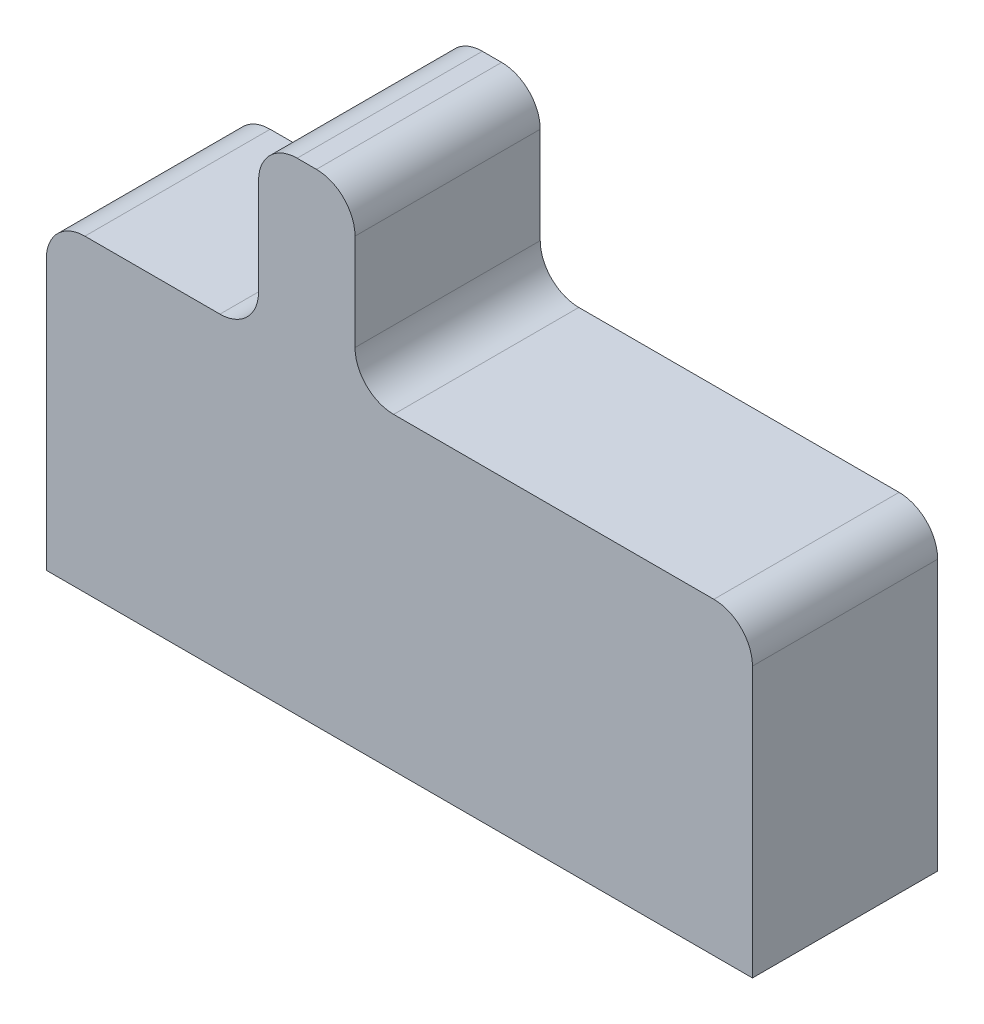
ISO-10303-21;
HEADER;
FILE_DESCRIPTION(('STEP AP214'),'2;1');
FILE_NAME('part.step','',(''),(''),'','','');
FILE_SCHEMA(('AUTOMOTIVE_DESIGN { 1 0 10303 214 1 1 1 1 }'));
ENDSEC;
DATA;
#1=APPLICATION_CONTEXT('core data for automotive mechanical design processes');
#2=APPLICATION_PROTOCOL_DEFINITION('international standard','automotive_design',2000,#1);
#3=PRODUCT_CONTEXT('',#1,'mechanical');
#4=PRODUCT('Part','Part','',(#3));
#5=PRODUCT_RELATED_PRODUCT_CATEGORY('part','',(#4));
#6=PRODUCT_DEFINITION_FORMATION('','',#4);
#7=PRODUCT_DEFINITION_CONTEXT('part definition',#1,'design');
#8=PRODUCT_DEFINITION('design','',#6,#7);
#9=PRODUCT_DEFINITION_SHAPE('','',#8);
#10=(LENGTH_UNIT() NAMED_UNIT(*) SI_UNIT(.MILLI.,.METRE.));
#11=(NAMED_UNIT(*) PLANE_ANGLE_UNIT() SI_UNIT($,.RADIAN.));
#12=(NAMED_UNIT(*) SI_UNIT($,.STERADIAN.) SOLID_ANGLE_UNIT());
#13=UNCERTAINTY_MEASURE_WITH_UNIT(LENGTH_MEASURE(1.E-05),#10,'distance_accuracy_value','');
#14=(GEOMETRIC_REPRESENTATION_CONTEXT(3) GLOBAL_UNCERTAINTY_ASSIGNED_CONTEXT((#13)) GLOBAL_UNIT_ASSIGNED_CONTEXT((#10,
#11,#12)) REPRESENTATION_CONTEXT('',''));
#15=CARTESIAN_POINT('',(0.,0.,0.));
#16=DIRECTION('',(0.,0.,1.));
#17=DIRECTION('',(1.,0.,0.));
#18=AXIS2_PLACEMENT_3D('',#15,#16,#17);
#19=CARTESIAN_POINT('',(1.83,0.8,0.96));
#20=DIRECTION('',(-1.,0.,0.));
#21=DIRECTION('',(0.,-1.,0.));
#22=AXIS2_PLACEMENT_3D('',#19,#20,#21);
#23=PLANE('',#22);
#24=DIRECTION('',(0.,1.,0.));
#25=VECTOR('',#24,1.);
#26=CARTESIAN_POINT('',(1.83,0.8,0.));
#27=LINE('',#26,#25);
#28=CARTESIAN_POINT('',(1.83,-0.8,0.));
#29=VERTEX_POINT('',#28);
#30=CARTESIAN_POINT('',(1.83,0.6,0.));
#31=VERTEX_POINT('',#30);
#32=EDGE_CURVE('E161',#29,#31,#27,.T.);
#33=ORIENTED_EDGE('',*,*,#32,.T.);
#34=DIRECTION('',(0.,0.,-1.));
#35=VECTOR('',#34,1.);
#36=CARTESIAN_POINT('',(1.83,0.6,0.96));
#37=LINE('',#36,#35);
#38=CARTESIAN_POINT('',(1.83,0.6,0.96));
#39=VERTEX_POINT('',#38);
#40=EDGE_CURVE('E216',#31,#39,#37,.F.);
#41=ORIENTED_EDGE('',*,*,#40,.T.);
#42=DIRECTION('',(0.,1.,0.));
#43=VECTOR('',#42,1.);
#44=CARTESIAN_POINT('',(1.83,0.8,0.96));
#45=LINE('',#44,#43);
#46=CARTESIAN_POINT('',(1.83,-0.8,0.96));
#47=VERTEX_POINT('',#46);
#48=EDGE_CURVE('E180',#47,#39,#45,.T.);
#49=ORIENTED_EDGE('',*,*,#48,.F.);
#50=DIRECTION('',(0.,0.,-1.));
#51=VECTOR('',#50,1.);
#52=CARTESIAN_POINT('',(1.83,-0.8,0.96));
#53=LINE('',#52,#51);
#54=EDGE_CURVE('E152',#47,#29,#53,.T.);
#55=ORIENTED_EDGE('',*,*,#54,.T.);
#56=EDGE_LOOP('',(#33,#41,#49,#55));
#57=FACE_BOUND('',#56,.T.);
#58=ADVANCED_FACE('F32',(#57),#23,.F.);
#59=CARTESIAN_POINT('',(-0.23,0.8,0.96));
#60=DIRECTION('',(0.,-1.,0.));
#61=DIRECTION('',(1.,0.,0.));
#62=AXIS2_PLACEMENT_3D('',#59,#60,#61);
#63=PLANE('',#62);
#64=DIRECTION('',(-1.,0.,0.));
#65=VECTOR('',#64,1.);
#66=CARTESIAN_POINT('',(-0.23,0.8,0.96));
#67=LINE('',#66,#65);
#68=CARTESIAN_POINT('',(1.63,0.8,0.96));
#69=VERTEX_POINT('',#68);
#70=CARTESIAN_POINT('',(-0.0299999999999998,0.8,0.96));
#71=VERTEX_POINT('',#70);
#72=EDGE_CURVE('E244',#69,#71,#67,.T.);
#73=ORIENTED_EDGE('',*,*,#72,.F.);
#74=DIRECTION('',(0.,0.,-1.));
#75=VECTOR('',#74,1.);
#76=CARTESIAN_POINT('',(1.63,0.8,0.96));
#77=LINE('',#76,#75);
#78=CARTESIAN_POINT('',(1.63,0.8,0.));
#79=VERTEX_POINT('',#78);
#80=EDGE_CURVE('E213',#69,#79,#77,.T.);
#81=ORIENTED_EDGE('',*,*,#80,.T.);
#82=DIRECTION('',(-1.,0.,0.));
#83=VECTOR('',#82,1.);
#84=CARTESIAN_POINT('',(-0.23,0.8,0.));
#85=LINE('',#84,#83);
#86=CARTESIAN_POINT('',(-0.0299999999999998,0.8,0.));
#87=VERTEX_POINT('',#86);
#88=EDGE_CURVE('E164',#79,#87,#85,.T.);
#89=ORIENTED_EDGE('',*,*,#88,.T.);
#90=DIRECTION('',(0.,0.,-1.));
#91=VECTOR('',#90,1.);
#92=CARTESIAN_POINT('',(-0.0299999999999998,0.8,0.96));
#93=LINE('',#92,#91);
#94=EDGE_CURVE('E211',#87,#71,#93,.F.);
#95=ORIENTED_EDGE('',*,*,#94,.T.);
#96=EDGE_LOOP('',(#73,#81,#89,#95));
#97=FACE_BOUND('',#96,.T.);
#98=ADVANCED_FACE('F237',(#97),#63,.F.);
#99=CARTESIAN_POINT('',(-0.23,1.7,0.96));
#100=DIRECTION('',(-1.,0.,0.));
#101=DIRECTION('',(0.,-1.,0.));
#102=AXIS2_PLACEMENT_3D('',#99,#100,#101);
#103=PLANE('',#102);
#104=DIRECTION('',(0.,1.,0.));
#105=VECTOR('',#104,1.);
#106=CARTESIAN_POINT('',(-0.23,1.7,0.));
#107=LINE('',#106,#105);
#108=CARTESIAN_POINT('',(-0.23,1.,0.));
#109=VERTEX_POINT('',#108);
#110=CARTESIAN_POINT('',(-0.23,1.5,0.));
#111=VERTEX_POINT('',#110);
#112=EDGE_CURVE('E167',#109,#111,#107,.T.);
#113=ORIENTED_EDGE('',*,*,#112,.T.);
#114=DIRECTION('',(0.,0.,-1.));
#115=VECTOR('',#114,1.);
#116=CARTESIAN_POINT('',(-0.23,1.5,0.96));
#117=LINE('',#116,#115);
#118=CARTESIAN_POINT('',(-0.23,1.5,0.96));
#119=VERTEX_POINT('',#118);
#120=EDGE_CURVE('E197',#111,#119,#117,.F.);
#121=ORIENTED_EDGE('',*,*,#120,.T.);
#122=DIRECTION('',(0.,1.,0.));
#123=VECTOR('',#122,1.);
#124=CARTESIAN_POINT('',(-0.23,1.7,0.96));
#125=LINE('',#124,#123);
#126=CARTESIAN_POINT('',(-0.23,1.,0.96));
#127=VERTEX_POINT('',#126);
#128=EDGE_CURVE('E242',#127,#119,#125,.T.);
#129=ORIENTED_EDGE('',*,*,#128,.F.);
#130=DIRECTION('',(0.,0.,-1.));
#131=VECTOR('',#130,1.);
#132=CARTESIAN_POINT('',(-0.23,1.,0.));
#133=LINE('',#132,#131);
#134=EDGE_CURVE('E194',#127,#109,#133,.T.);
#135=ORIENTED_EDGE('',*,*,#134,.T.);
#136=EDGE_LOOP('',(#113,#121,#129,#135));
#137=FACE_BOUND('',#136,.T.);
#138=ADVANCED_FACE('F246',(#137),#103,.F.);
#139=CARTESIAN_POINT('',(-0.73,1.7,0.96));
#140=DIRECTION('',(0.,-1.,0.));
#141=DIRECTION('',(0.,0.,-1.));
#142=AXIS2_PLACEMENT_3D('',#139,#140,#141);
#143=PLANE('',#142);
#144=DIRECTION('',(-1.,0.,0.));
#145=VECTOR('',#144,1.);
#146=CARTESIAN_POINT('',(-0.73,1.7,0.96));
#147=LINE('',#146,#145);
#148=CARTESIAN_POINT('',(-0.43,1.7,0.96));
#149=VERTEX_POINT('',#148);
#150=CARTESIAN_POINT('',(-0.53,1.7,0.96));
#151=VERTEX_POINT('',#150);
#152=EDGE_CURVE('E248',#149,#151,#147,.T.);
#153=ORIENTED_EDGE('',*,*,#152,.F.);
#154=DIRECTION('',(0.,0.,-1.));
#155=VECTOR('',#154,1.);
#156=CARTESIAN_POINT('',(-0.43,1.7,0.96));
#157=LINE('',#156,#155);
#158=CARTESIAN_POINT('',(-0.43,1.7,0.));
#159=VERTEX_POINT('',#158);
#160=EDGE_CURVE('E183',#149,#159,#157,.T.);
#161=ORIENTED_EDGE('',*,*,#160,.T.);
#162=DIRECTION('',(-1.,0.,0.));
#163=VECTOR('',#162,1.);
#164=CARTESIAN_POINT('',(-0.73,1.7,0.));
#165=LINE('',#164,#163);
#166=CARTESIAN_POINT('',(-0.53,1.7,0.));
#167=VERTEX_POINT('',#166);
#168=EDGE_CURVE('E170',#159,#167,#165,.T.);
#169=ORIENTED_EDGE('',*,*,#168,.T.);
#170=DIRECTION('',(0.,0.,-1.));
#171=VECTOR('',#170,1.);
#172=CARTESIAN_POINT('',(-0.53,1.7,0.96));
#173=LINE('',#172,#171);
#174=EDGE_CURVE('E151',#167,#151,#173,.F.);
#175=ORIENTED_EDGE('',*,*,#174,.T.);
#176=EDGE_LOOP('',(#153,#161,#169,#175));
#177=FACE_BOUND('',#176,.T.);
#178=ADVANCED_FACE('F298',(#177),#143,.F.);
#179=CARTESIAN_POINT('',(-0.73,0.8,0.96));
#180=DIRECTION('',(1.,0.,0.));
#181=DIRECTION('',(0.,0.,-1.));
#182=AXIS2_PLACEMENT_3D('',#179,#180,#181);
#183=PLANE('',#182);
#184=DIRECTION('',(0.,-1.,0.));
#185=VECTOR('',#184,1.);
#186=CARTESIAN_POINT('',(-0.73,0.8,0.96));
#187=LINE('',#186,#185);
#188=CARTESIAN_POINT('',(-0.73,1.5,0.96));
#189=VERTEX_POINT('',#188);
#190=CARTESIAN_POINT('',(-0.73,1.,0.96));
#191=VERTEX_POINT('',#190);
#192=EDGE_CURVE('E251',#189,#191,#187,.T.);
#193=ORIENTED_EDGE('',*,*,#192,.F.);
#194=DIRECTION('',(0.,0.,-1.));
#195=VECTOR('',#194,1.);
#196=CARTESIAN_POINT('',(-0.73,1.5,0.96));
#197=LINE('',#196,#195);
#198=CARTESIAN_POINT('',(-0.73,1.5,0.));
#199=VERTEX_POINT('',#198);
#200=EDGE_CURVE('E208',#189,#199,#197,.T.);
#201=ORIENTED_EDGE('',*,*,#200,.T.);
#202=DIRECTION('',(0.,-1.,0.));
#203=VECTOR('',#202,1.);
#204=CARTESIAN_POINT('',(-0.73,0.8,0.));
#205=LINE('',#204,#203);
#206=CARTESIAN_POINT('',(-0.73,1.,0.));
#207=VERTEX_POINT('',#206);
#208=EDGE_CURVE('E173',#199,#207,#205,.T.);
#209=ORIENTED_EDGE('',*,*,#208,.T.);
#210=DIRECTION('',(0.,0.,-1.));
#211=VECTOR('',#210,1.);
#212=CARTESIAN_POINT('',(-0.73,1.,0.96));
#213=LINE('',#212,#211);
#214=EDGE_CURVE('E206',#207,#191,#213,.F.);
#215=ORIENTED_EDGE('',*,*,#214,.T.);
#216=EDGE_LOOP('',(#193,#201,#209,#215));
#217=FACE_BOUND('',#216,.T.);
#218=ADVANCED_FACE('F303',(#217),#183,.F.);
#219=CARTESIAN_POINT('',(-1.83,0.8,0.96));
#220=DIRECTION('',(0.,-1.,0.));
#221=DIRECTION('',(0.,0.,-1.));
#222=AXIS2_PLACEMENT_3D('',#219,#220,#221);
#223=PLANE('',#222);
#224=DIRECTION('',(-1.,0.,0.));
#225=VECTOR('',#224,1.);
#226=CARTESIAN_POINT('',(-1.83,0.8,0.));
#227=LINE('',#226,#225);
#228=CARTESIAN_POINT('',(-0.93,0.8,0.));
#229=VERTEX_POINT('',#228);
#230=CARTESIAN_POINT('',(-1.63,0.8,0.));
#231=VERTEX_POINT('',#230);
#232=EDGE_CURVE('E176',#229,#231,#227,.T.);
#233=ORIENTED_EDGE('',*,*,#232,.T.);
#234=DIRECTION('',(0.,0.,-1.));
#235=VECTOR('',#234,1.);
#236=CARTESIAN_POINT('',(-1.63,0.8,0.96));
#237=LINE('',#236,#235);
#238=CARTESIAN_POINT('',(-1.63,0.8,0.96));
#239=VERTEX_POINT('',#238);
#240=EDGE_CURVE('E55',#231,#239,#237,.F.);
#241=ORIENTED_EDGE('',*,*,#240,.T.);
#242=DIRECTION('',(-1.,0.,0.));
#243=VECTOR('',#242,1.);
#244=CARTESIAN_POINT('',(-1.83,0.8,0.96));
#245=LINE('',#244,#243);
#246=CARTESIAN_POINT('',(-0.93,0.8,0.96));
#247=VERTEX_POINT('',#246);
#248=EDGE_CURVE('E142',#247,#239,#245,.T.);
#249=ORIENTED_EDGE('',*,*,#248,.F.);
#250=DIRECTION('',(0.,0.,-1.));
#251=VECTOR('',#250,1.);
#252=CARTESIAN_POINT('',(-0.93,0.8,0.));
#253=LINE('',#252,#251);
#254=EDGE_CURVE('E220',#247,#229,#253,.T.);
#255=ORIENTED_EDGE('',*,*,#254,.T.);
#256=EDGE_LOOP('',(#233,#241,#249,#255));
#257=FACE_BOUND('',#256,.T.);
#258=ADVANCED_FACE('F307',(#257),#223,.F.);
#259=CARTESIAN_POINT('',(-1.83,0.8,0.96));
#260=DIRECTION('',(1.,0.,0.));
#261=DIRECTION('',(0.,1.,0.));
#262=AXIS2_PLACEMENT_3D('',#259,#260,#261);
#263=PLANE('',#262);
#264=DIRECTION('',(0.,-1.,0.));
#265=VECTOR('',#264,1.);
#266=CARTESIAN_POINT('',(-1.83,0.8,0.96));
#267=LINE('',#266,#265);
#268=CARTESIAN_POINT('',(-1.83,0.6,0.96));
#269=VERTEX_POINT('',#268);
#270=CARTESIAN_POINT('',(-1.83,-0.8,0.96));
#271=VERTEX_POINT('',#270);
#272=EDGE_CURVE('E131',#269,#271,#267,.T.);
#273=ORIENTED_EDGE('',*,*,#272,.F.);
#274=DIRECTION('',(0.,0.,-1.));
#275=VECTOR('',#274,1.);
#276=CARTESIAN_POINT('',(-1.83,0.6,0.96));
#277=LINE('',#276,#275);
#278=CARTESIAN_POINT('',(-1.83,0.6,0.));
#279=VERTEX_POINT('',#278);
#280=EDGE_CURVE('E218',#269,#279,#277,.T.);
#281=ORIENTED_EDGE('',*,*,#280,.T.);
#282=DIRECTION('',(0.,-1.,0.));
#283=VECTOR('',#282,1.);
#284=CARTESIAN_POINT('',(-1.83,0.8,0.));
#285=LINE('',#284,#283);
#286=CARTESIAN_POINT('',(-1.83,-0.8,0.));
#287=VERTEX_POINT('',#286);
#288=EDGE_CURVE('E148',#279,#287,#285,.T.);
#289=ORIENTED_EDGE('',*,*,#288,.T.);
#290=DIRECTION('',(0.,0.,-1.));
#291=VECTOR('',#290,1.);
#292=CARTESIAN_POINT('',(-1.83,-0.8,0.96));
#293=LINE('',#292,#291);
#294=EDGE_CURVE('E145',#271,#287,#293,.T.);
#295=ORIENTED_EDGE('',*,*,#294,.F.);
#296=EDGE_LOOP('',(#273,#281,#289,#295));
#297=FACE_BOUND('',#296,.T.);
#298=ADVANCED_FACE('F146',(#297),#263,.F.);
#299=CARTESIAN_POINT('',(-1.83,-0.8,0.96));
#300=DIRECTION('',(0.,1.,0.));
#301=DIRECTION('',(0.,0.,1.));
#302=AXIS2_PLACEMENT_3D('',#299,#300,#301);
#303=PLANE('',#302);
#304=DIRECTION('',(1.,0.,0.));
#305=VECTOR('',#304,1.);
#306=CARTESIAN_POINT('',(-1.83,-0.8,0.));
#307=LINE('',#306,#305);
#308=EDGE_CURVE('E179',#287,#29,#307,.T.);
#309=ORIENTED_EDGE('',*,*,#308,.T.);
#310=ORIENTED_EDGE('',*,*,#54,.F.);
#311=DIRECTION('',(1.,0.,0.));
#312=VECTOR('',#311,1.);
#313=CARTESIAN_POINT('',(-1.83,-0.8,0.96));
#314=LINE('',#313,#312);
#315=EDGE_CURVE('E137',#271,#47,#314,.T.);
#316=ORIENTED_EDGE('',*,*,#315,.F.);
#317=ORIENTED_EDGE('',*,*,#294,.T.);
#318=EDGE_LOOP('',(#309,#310,#316,#317));
#319=FACE_BOUND('',#318,.T.);
#320=ADVANCED_FACE('F154',(#319),#303,.F.);
#321=CARTESIAN_POINT('',(0.,0.,0.96));
#322=DIRECTION('',(0.,0.,1.));
#323=DIRECTION('',(1.,0.,0.));
#324=AXIS2_PLACEMENT_3D('',#321,#322,#323);
#325=PLANE('',#324);
#326=ORIENTED_EDGE('',*,*,#128,.T.);
#327=CARTESIAN_POINT('',(-0.43,1.5,0.96));
#328=DIRECTION('',(0.,0.,1.));
#329=DIRECTION('',(1.,0.,0.));
#330=AXIS2_PLACEMENT_3D('',#327,#328,#329);
#331=CIRCLE('',#330,0.2);
#332=EDGE_CURVE('E204',#119,#149,#331,.T.);
#333=ORIENTED_EDGE('',*,*,#332,.T.);
#334=ORIENTED_EDGE('',*,*,#152,.T.);
#335=CARTESIAN_POINT('',(-0.53,1.5,0.96));
#336=DIRECTION('',(0.,0.,1.));
#337=DIRECTION('',(1.,0.,0.));
#338=AXIS2_PLACEMENT_3D('',#335,#336,#337);
#339=CIRCLE('',#338,0.2);
#340=EDGE_CURVE('E202',#151,#189,#339,.T.);
#341=ORIENTED_EDGE('',*,*,#340,.T.);
#342=ORIENTED_EDGE('',*,*,#192,.T.);
#343=CARTESIAN_POINT('',(-0.93,1.,0.96));
#344=DIRECTION('',(0.,0.,1.));
#345=DIRECTION('',(1.,0.,0.));
#346=AXIS2_PLACEMENT_3D('',#343,#344,#345);
#347=CIRCLE('',#346,0.2);
#348=EDGE_CURVE('E226',#191,#247,#347,.F.);
#349=ORIENTED_EDGE('',*,*,#348,.T.);
#350=ORIENTED_EDGE('',*,*,#248,.T.);
#351=CARTESIAN_POINT('',(-1.63,0.6,0.96));
#352=DIRECTION('',(0.,0.,1.));
#353=DIRECTION('',(1.,0.,0.));
#354=AXIS2_PLACEMENT_3D('',#351,#352,#353);
#355=CIRCLE('',#354,0.2);
#356=EDGE_CURVE('E47',#239,#269,#355,.T.);
#357=ORIENTED_EDGE('',*,*,#356,.T.);
#358=ORIENTED_EDGE('',*,*,#272,.T.);
#359=ORIENTED_EDGE('',*,*,#315,.T.);
#360=ORIENTED_EDGE('',*,*,#48,.T.);
#361=CARTESIAN_POINT('',(1.63,0.6,0.96));
#362=DIRECTION('',(0.,0.,1.));
#363=DIRECTION('',(1.,0.,0.));
#364=AXIS2_PLACEMENT_3D('',#361,#362,#363);
#365=CIRCLE('',#364,0.2);
#366=EDGE_CURVE('E200',#39,#69,#365,.T.);
#367=ORIENTED_EDGE('',*,*,#366,.T.);
#368=ORIENTED_EDGE('',*,*,#72,.T.);
#369=CARTESIAN_POINT('',(-0.0299999999999998,1.,0.96));
#370=DIRECTION('',(0.,0.,1.));
#371=DIRECTION('',(1.,0.,0.));
#372=AXIS2_PLACEMENT_3D('',#369,#370,#371);
#373=CIRCLE('',#372,0.2);
#374=EDGE_CURVE('E11',#71,#127,#373,.F.);
#375=ORIENTED_EDGE('',*,*,#374,.T.);
#376=EDGE_LOOP('',(#326,#333,#334,#341,#342,#349,#350,#357,#358,#359,#360,#367,#368,#375));
#377=FACE_BOUND('',#376,.T.);
#378=ADVANCED_FACE('F134',(#377),#325,.T.);
#379=CARTESIAN_POINT('',(0.,0.,0.));
#380=DIRECTION('',(0.,0.,1.));
#381=DIRECTION('',(1.,0.,0.));
#382=AXIS2_PLACEMENT_3D('',#379,#380,#381);
#383=PLANE('',#382);
#384=ORIENTED_EDGE('',*,*,#168,.F.);
#385=CARTESIAN_POINT('',(-0.43,1.5,0.));
#386=DIRECTION('',(0.,0.,1.));
#387=DIRECTION('',(1.,0.,0.));
#388=AXIS2_PLACEMENT_3D('',#385,#386,#387);
#389=CIRCLE('',#388,0.2);
#390=EDGE_CURVE('E192',#159,#111,#389,.F.);
#391=ORIENTED_EDGE('',*,*,#390,.T.);
#392=ORIENTED_EDGE('',*,*,#112,.F.);
#393=CARTESIAN_POINT('',(-0.0299999999999998,1.,0.));
#394=DIRECTION('',(0.,0.,1.));
#395=DIRECTION('',(1.,0.,0.));
#396=AXIS2_PLACEMENT_3D('',#393,#394,#395);
#397=CIRCLE('',#396,0.2);
#398=EDGE_CURVE('E40',#109,#87,#397,.T.);
#399=ORIENTED_EDGE('',*,*,#398,.T.);
#400=ORIENTED_EDGE('',*,*,#88,.F.);
#401=CARTESIAN_POINT('',(1.63,0.6,0.));
#402=DIRECTION('',(0.,0.,1.));
#403=DIRECTION('',(1.,0.,0.));
#404=AXIS2_PLACEMENT_3D('',#401,#402,#403);
#405=CIRCLE('',#404,0.2);
#406=EDGE_CURVE('E188',#79,#31,#405,.F.);
#407=ORIENTED_EDGE('',*,*,#406,.T.);
#408=ORIENTED_EDGE('',*,*,#32,.F.);
#409=ORIENTED_EDGE('',*,*,#308,.F.);
#410=ORIENTED_EDGE('',*,*,#288,.F.);
#411=CARTESIAN_POINT('',(-1.63,0.6,0.));
#412=DIRECTION('',(0.,0.,1.));
#413=DIRECTION('',(1.,0.,0.));
#414=AXIS2_PLACEMENT_3D('',#411,#412,#413);
#415=CIRCLE('',#414,0.2);
#416=EDGE_CURVE('E186',#279,#231,#415,.F.);
#417=ORIENTED_EDGE('',*,*,#416,.T.);
#418=ORIENTED_EDGE('',*,*,#232,.F.);
#419=CARTESIAN_POINT('',(-0.93,1.,0.));
#420=DIRECTION('',(0.,0.,1.));
#421=DIRECTION('',(1.,0.,0.));
#422=AXIS2_PLACEMENT_3D('',#419,#420,#421);
#423=CIRCLE('',#422,0.2);
#424=EDGE_CURVE('E224',#229,#207,#423,.T.);
#425=ORIENTED_EDGE('',*,*,#424,.T.);
#426=ORIENTED_EDGE('',*,*,#208,.F.);
#427=CARTESIAN_POINT('',(-0.53,1.5,0.));
#428=DIRECTION('',(0.,0.,1.));
#429=DIRECTION('',(1.,0.,0.));
#430=AXIS2_PLACEMENT_3D('',#427,#428,#429);
#431=CIRCLE('',#430,0.2);
#432=EDGE_CURVE('E190',#199,#167,#431,.F.);
#433=ORIENTED_EDGE('',*,*,#432,.T.);
#434=EDGE_LOOP('',(#384,#391,#392,#399,#400,#407,#408,#409,#410,#417,#418,#425,#426,#433));
#435=FACE_BOUND('',#434,.T.);
#436=ADVANCED_FACE('F231',(#435),#383,.F.);
#437=CARTESIAN_POINT('',(-0.43,1.5,0.96));
#438=DIRECTION('',(0.,0.,-1.));
#439=DIRECTION('',(-1.,0.,0.));
#440=AXIS2_PLACEMENT_3D('',#437,#438,#439);
#441=CYLINDRICAL_SURFACE('',#440,0.2);
#442=ORIENTED_EDGE('',*,*,#332,.F.);
#443=ORIENTED_EDGE('',*,*,#120,.F.);
#444=ORIENTED_EDGE('',*,*,#390,.F.);
#445=ORIENTED_EDGE('',*,*,#160,.F.);
#446=EDGE_LOOP('',(#442,#443,#444,#445));
#447=FACE_BOUND('',#446,.T.);
#448=ADVANCED_FACE('F277',(#447),#441,.T.);
#449=CARTESIAN_POINT('',(-0.53,1.5,0.96));
#450=DIRECTION('',(0.,0.,-1.));
#451=DIRECTION('',(-1.,0.,0.));
#452=AXIS2_PLACEMENT_3D('',#449,#450,#451);
#453=CYLINDRICAL_SURFACE('',#452,0.2);
#454=ORIENTED_EDGE('',*,*,#340,.F.);
#455=ORIENTED_EDGE('',*,*,#174,.F.);
#456=ORIENTED_EDGE('',*,*,#432,.F.);
#457=ORIENTED_EDGE('',*,*,#200,.F.);
#458=EDGE_LOOP('',(#454,#455,#456,#457));
#459=FACE_BOUND('',#458,.T.);
#460=ADVANCED_FACE('F269',(#459),#453,.T.);
#461=CARTESIAN_POINT('',(1.63,0.6,0.96));
#462=DIRECTION('',(0.,0.,-1.));
#463=DIRECTION('',(-1.,0.,0.));
#464=AXIS2_PLACEMENT_3D('',#461,#462,#463);
#465=CYLINDRICAL_SURFACE('',#464,0.2);
#466=ORIENTED_EDGE('',*,*,#366,.F.);
#467=ORIENTED_EDGE('',*,*,#40,.F.);
#468=ORIENTED_EDGE('',*,*,#406,.F.);
#469=ORIENTED_EDGE('',*,*,#80,.F.);
#470=EDGE_LOOP('',(#466,#467,#468,#469));
#471=FACE_BOUND('',#470,.T.);
#472=ADVANCED_FACE('F267',(#471),#465,.T.);
#473=CARTESIAN_POINT('',(-1.63,0.6,0.96));
#474=DIRECTION('',(0.,0.,-1.));
#475=DIRECTION('',(-1.,0.,0.));
#476=AXIS2_PLACEMENT_3D('',#473,#474,#475);
#477=CYLINDRICAL_SURFACE('',#476,0.2);
#478=ORIENTED_EDGE('',*,*,#356,.F.);
#479=ORIENTED_EDGE('',*,*,#240,.F.);
#480=ORIENTED_EDGE('',*,*,#416,.F.);
#481=ORIENTED_EDGE('',*,*,#280,.F.);
#482=EDGE_LOOP('',(#478,#479,#480,#481));
#483=FACE_BOUND('',#482,.T.);
#484=ADVANCED_FACE('F260',(#483),#477,.T.);
#485=CARTESIAN_POINT('',(-0.93,1.,0.96));
#486=DIRECTION('',(0.,0.,1.));
#487=DIRECTION('',(1.,0.,0.));
#488=AXIS2_PLACEMENT_3D('',#485,#486,#487);
#489=CYLINDRICAL_SURFACE('',#488,0.2);
#490=ORIENTED_EDGE('',*,*,#348,.F.);
#491=ORIENTED_EDGE('',*,*,#214,.F.);
#492=ORIENTED_EDGE('',*,*,#424,.F.);
#493=ORIENTED_EDGE('',*,*,#254,.F.);
#494=EDGE_LOOP('',(#490,#491,#492,#493));
#495=FACE_BOUND('',#494,.T.);
#496=ADVANCED_FACE('F275',(#495),#489,.F.);
#497=CARTESIAN_POINT('',(-0.0299999999999998,1.,0.96));
#498=DIRECTION('',(0.,0.,1.));
#499=DIRECTION('',(1.,0.,0.));
#500=AXIS2_PLACEMENT_3D('',#497,#498,#499);
#501=CYLINDRICAL_SURFACE('',#500,0.2);
#502=ORIENTED_EDGE('',*,*,#374,.F.);
#503=ORIENTED_EDGE('',*,*,#94,.F.);
#504=ORIENTED_EDGE('',*,*,#398,.F.);
#505=ORIENTED_EDGE('',*,*,#134,.F.);
#506=EDGE_LOOP('',(#502,#503,#504,#505));
#507=FACE_BOUND('',#506,.T.);
#508=ADVANCED_FACE('F34',(#507),#501,.F.);
#509=CLOSED_SHELL('',(#58,#98,#138,#178,#218,#258,#298,#320,#378,#436,#448,#460,#472,#484,#496,#508));
#510=MANIFOLD_SOLID_BREP('B2',#509);
#511=ADVANCED_BREP_SHAPE_REPRESENTATION('',(#18,#510),#14);
#512=SHAPE_DEFINITION_REPRESENTATION(#9,#511);
ENDSEC;
END-ISO-10303-21;
